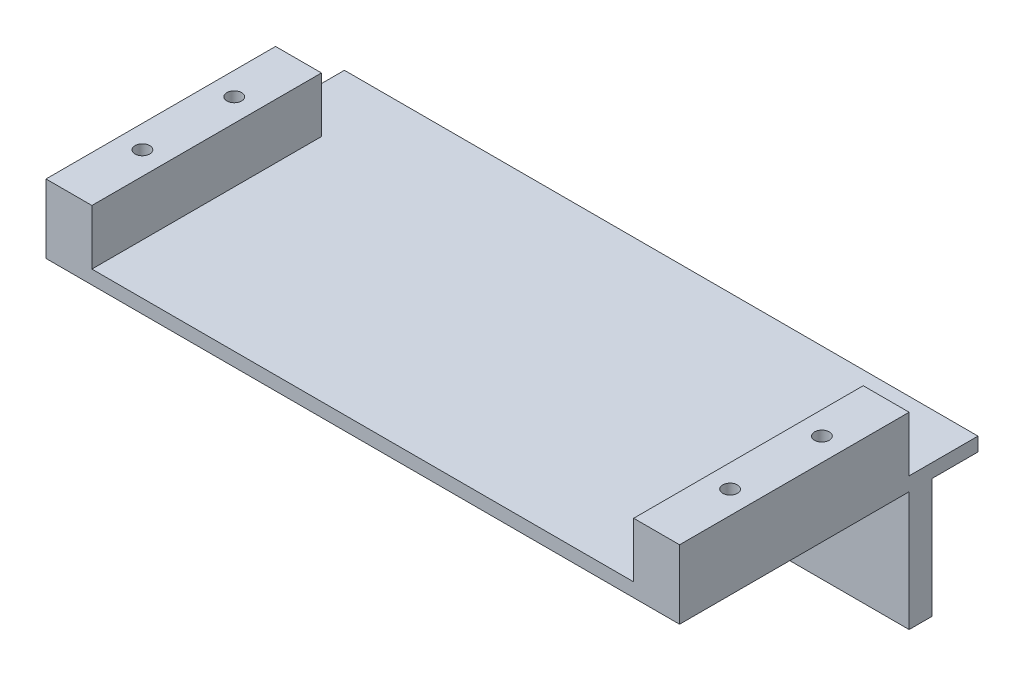
ISO-10303-21;
HEADER;
FILE_DESCRIPTION(('STEP AP214'),'2;1');
FILE_NAME('part.step','',(''),(''),'','','');
FILE_SCHEMA(('AUTOMOTIVE_DESIGN { 1 0 10303 214 1 1 1 1 }'));
ENDSEC;
DATA;
#1=APPLICATION_CONTEXT('core data for automotive mechanical design processes');
#2=APPLICATION_PROTOCOL_DEFINITION('international standard','automotive_design',2000,#1);
#3=PRODUCT_CONTEXT('',#1,'mechanical');
#4=PRODUCT('Part','Part','',(#3));
#5=PRODUCT_RELATED_PRODUCT_CATEGORY('part','',(#4));
#6=PRODUCT_DEFINITION_FORMATION('','',#4);
#7=PRODUCT_DEFINITION_CONTEXT('part definition',#1,'design');
#8=PRODUCT_DEFINITION('design','',#6,#7);
#9=PRODUCT_DEFINITION_SHAPE('','',#8);
#10=(LENGTH_UNIT() NAMED_UNIT(*) SI_UNIT(.MILLI.,.METRE.));
#11=(NAMED_UNIT(*) PLANE_ANGLE_UNIT() SI_UNIT($,.RADIAN.));
#12=(NAMED_UNIT(*) SI_UNIT($,.STERADIAN.) SOLID_ANGLE_UNIT());
#13=UNCERTAINTY_MEASURE_WITH_UNIT(LENGTH_MEASURE(1.E-05),#10,'distance_accuracy_value','');
#14=(GEOMETRIC_REPRESENTATION_CONTEXT(3) GLOBAL_UNCERTAINTY_ASSIGNED_CONTEXT((#13)) GLOBAL_UNIT_ASSIGNED_CONTEXT((#10,
#11,#12)) REPRESENTATION_CONTEXT('',''));
#15=CARTESIAN_POINT('',(0.,0.,0.));
#16=DIRECTION('',(0.,0.,1.));
#17=DIRECTION('',(1.,0.,0.));
#18=AXIS2_PLACEMENT_3D('',#15,#16,#17);
#19=CARTESIAN_POINT('',(0.,0.,5.));
#20=DIRECTION('',(0.,0.,1.));
#21=DIRECTION('',(1.,0.,0.));
#22=AXIS2_PLACEMENT_3D('',#19,#20,#21);
#23=PLANE('',#22);
#24=CARTESIAN_POINT('',(-29.7979797979798,-1.4299957918934,5.));
#25=DIRECTION('',(0.,0.,1.));
#26=DIRECTION('',(1.,0.,0.));
#27=AXIS2_PLACEMENT_3D('',#24,#25,#26);
#28=CIRCLE('',#27,2.1);
#29=CARTESIAN_POINT('',(-27.6979797979798,-1.4299957918934,5.));
#30=VERTEX_POINT('',#29);
#31=EDGE_CURVE('E289',#30,#30,#28,.T.);
#32=ORIENTED_EDGE('',*,*,#31,.F.);
#33=EDGE_LOOP('',(#32));
#34=FACE_BOUND('',#33,.T.);
#35=DIRECTION('',(0.,-1.,0.));
#36=VECTOR('',#35,1.);
#37=CARTESIAN_POINT('',(-49.7979797979798,14.5700042081066,5.));
#38=LINE('',#37,#36);
#39=CARTESIAN_POINT('',(-49.7979797979798,14.5700042081066,5.));
#40=VERTEX_POINT('',#39);
#41=CARTESIAN_POINT('',(-49.7979797979798,-11.4299957918934,5.));
#42=VERTEX_POINT('',#41);
#43=EDGE_CURVE('E297',#40,#42,#38,.T.);
#44=ORIENTED_EDGE('',*,*,#43,.T.);
#45=DIRECTION('',(1.,0.,0.));
#46=VECTOR('',#45,1.);
#47=CARTESIAN_POINT('',(-49.7979797979798,-11.4299957918934,5.));
#48=LINE('',#47,#46);
#49=CARTESIAN_POINT('',(88.2020202020202,-11.4299957918934,5.));
#50=VERTEX_POINT('',#49);
#51=EDGE_CURVE('E301',#42,#50,#48,.T.);
#52=ORIENTED_EDGE('',*,*,#51,.T.);
#53=DIRECTION('',(0.,1.,0.));
#54=VECTOR('',#53,1.);
#55=CARTESIAN_POINT('',(88.2020202020202,14.5700042081066,5.));
#56=LINE('',#55,#54);
#57=CARTESIAN_POINT('',(88.2020202020202,14.5700042081066,5.));
#58=VERTEX_POINT('',#57);
#59=EDGE_CURVE('E305',#50,#58,#56,.T.);
#60=ORIENTED_EDGE('',*,*,#59,.T.);
#61=DIRECTION('',(-1.,0.,0.));
#62=VECTOR('',#61,1.);
#63=CARTESIAN_POINT('',(-49.7979797979798,14.5700042081066,5.));
#64=LINE('',#63,#62);
#65=EDGE_CURVE('E309',#58,#40,#64,.T.);
#66=ORIENTED_EDGE('',*,*,#65,.T.);
#67=EDGE_LOOP('',(#44,#52,#60,#66));
#68=FACE_BOUND('',#67,.T.);
#69=CARTESIAN_POINT('',(68.2020202020202,-1.42999579189338,5.));
#70=DIRECTION('',(0.,0.,1.));
#71=DIRECTION('',(-1.,0.,0.));
#72=AXIS2_PLACEMENT_3D('',#69,#70,#71);
#73=CIRCLE('',#72,2.09999999999999);
#74=CARTESIAN_POINT('',(66.1020202020202,-1.42999579189338,5.));
#75=VERTEX_POINT('',#74);
#76=EDGE_CURVE('E281',#75,#75,#73,.T.);
#77=ORIENTED_EDGE('',*,*,#76,.F.);
#78=EDGE_LOOP('',(#77));
#79=FACE_BOUND('',#78,.T.);
#80=ADVANCED_FACE('F45',(#34,#68,#79),#23,.T.);
#81=CARTESIAN_POINT('',(0.,0.,0.));
#82=DIRECTION('',(0.,0.,1.));
#83=DIRECTION('',(1.,0.,0.));
#84=AXIS2_PLACEMENT_3D('',#81,#82,#83);
#85=PLANE('',#84);
#86=DIRECTION('',(0.,-1.,0.));
#87=VECTOR('',#86,1.);
#88=CARTESIAN_POINT('',(-49.7979797979798,14.5700042081066,0.));
#89=LINE('',#88,#87);
#90=CARTESIAN_POINT('',(-49.7979797979798,14.5700042081066,0.));
#91=VERTEX_POINT('',#90);
#92=CARTESIAN_POINT('',(-49.7979797979798,-11.4299957918934,0.));
#93=VERTEX_POINT('',#92);
#94=EDGE_CURVE('E293',#91,#93,#89,.T.);
#95=ORIENTED_EDGE('',*,*,#94,.F.);
#96=DIRECTION('',(-1.,0.,0.));
#97=VECTOR('',#96,1.);
#98=CARTESIAN_POINT('',(-49.7979797979798,14.5700042081066,0.));
#99=LINE('',#98,#97);
#100=CARTESIAN_POINT('',(88.2020202020202,14.5700042081066,0.));
#101=VERTEX_POINT('',#100);
#102=EDGE_CURVE('E302',#101,#91,#99,.T.);
#103=ORIENTED_EDGE('',*,*,#102,.F.);
#104=DIRECTION('',(0.,1.,0.));
#105=VECTOR('',#104,1.);
#106=CARTESIAN_POINT('',(88.2020202020202,14.5700042081066,0.));
#107=LINE('',#106,#105);
#108=CARTESIAN_POINT('',(88.2020202020202,-11.4299957918934,0.));
#109=VERTEX_POINT('',#108);
#110=EDGE_CURVE('E319',#109,#101,#107,.T.);
#111=ORIENTED_EDGE('',*,*,#110,.F.);
#112=DIRECTION('',(1.,0.,0.));
#113=VECTOR('',#112,1.);
#114=CARTESIAN_POINT('',(-49.7979797979798,-11.4299957918934,0.));
#115=LINE('',#114,#113);
#116=EDGE_CURVE('E316',#93,#109,#115,.T.);
#117=ORIENTED_EDGE('',*,*,#116,.F.);
#118=EDGE_LOOP('',(#95,#103,#111,#117));
#119=FACE_BOUND('',#118,.T.);
#120=CARTESIAN_POINT('',(-29.7979797979798,-1.4299957918934,0.));
#121=DIRECTION('',(0.,0.,1.));
#122=DIRECTION('',(1.,0.,0.));
#123=AXIS2_PLACEMENT_3D('',#120,#121,#122);
#124=CIRCLE('',#123,2.1);
#125=CARTESIAN_POINT('',(-27.6979797979798,-1.4299957918934,0.));
#126=VERTEX_POINT('',#125);
#127=EDGE_CURVE('E285',#126,#126,#124,.T.);
#128=ORIENTED_EDGE('',*,*,#127,.T.);
#129=EDGE_LOOP('',(#128));
#130=FACE_BOUND('',#129,.T.);
#131=CARTESIAN_POINT('',(68.2020202020202,-1.42999579189338,0.));
#132=DIRECTION('',(0.,0.,1.));
#133=DIRECTION('',(-1.,0.,0.));
#134=AXIS2_PLACEMENT_3D('',#131,#132,#133);
#135=CIRCLE('',#134,2.09999999999999);
#136=CARTESIAN_POINT('',(66.1020202020202,-1.42999579189338,0.));
#137=VERTEX_POINT('',#136);
#138=EDGE_CURVE('E280',#137,#137,#135,.T.);
#139=ORIENTED_EDGE('',*,*,#138,.T.);
#140=EDGE_LOOP('',(#139));
#141=FACE_BOUND('',#140,.T.);
#142=ADVANCED_FACE('F332',(#119,#130,#141),#85,.F.);
#143=CARTESIAN_POINT('',(-49.7979797979798,14.5700042081066,5.));
#144=DIRECTION('',(1.,0.,0.));
#145=DIRECTION('',(0.,0.,-1.));
#146=AXIS2_PLACEMENT_3D('',#143,#144,#145);
#147=PLANE('',#146);
#148=ORIENTED_EDGE('',*,*,#94,.T.);
#149=DIRECTION('',(0.,0.,-1.));
#150=VECTOR('',#149,1.);
#151=CARTESIAN_POINT('',(-49.7979797979798,-11.4299957918934,5.));
#152=LINE('',#151,#150);
#153=EDGE_CURVE('E11',#42,#93,#152,.T.);
#154=ORIENTED_EDGE('',*,*,#153,.F.);
#155=ORIENTED_EDGE('',*,*,#43,.F.);
#156=DIRECTION('',(0.,0.,1.));
#157=VECTOR('',#156,1.);
#158=CARTESIAN_POINT('',(-49.7979797979798,14.5700042081066,-10.));
#159=LINE('',#158,#157);
#160=CARTESIAN_POINT('',(-49.7979797979798,14.5700042081066,55.));
#161=VERTEX_POINT('',#160);
#162=EDGE_CURVE('E239',#40,#161,#159,.T.);
#163=ORIENTED_EDGE('',*,*,#162,.T.);
#164=DIRECTION('',(0.,-1.,0.));
#165=VECTOR('',#164,1.);
#166=CARTESIAN_POINT('',(-49.7979797979798,17.5700042081066,55.));
#167=LINE('',#166,#165);
#168=CARTESIAN_POINT('',(-49.7979797979798,29.5700042081066,55.));
#169=VERTEX_POINT('',#168);
#170=EDGE_CURVE('E276',#169,#161,#167,.T.);
#171=ORIENTED_EDGE('',*,*,#170,.F.);
#172=DIRECTION('',(0.,0.,1.));
#173=VECTOR('',#172,1.);
#174=CARTESIAN_POINT('',(-49.7979797979798,29.5700042081066,55.));
#175=LINE('',#174,#173);
#176=CARTESIAN_POINT('',(-49.7979797979798,29.5700042081066,5.00000000000001));
#177=VERTEX_POINT('',#176);
#178=EDGE_CURVE('E204',#177,#169,#175,.T.);
#179=ORIENTED_EDGE('',*,*,#178,.F.);
#180=DIRECTION('',(0.,-1.,0.));
#181=VECTOR('',#180,1.);
#182=CARTESIAN_POINT('',(-49.7979797979798,29.5700042081066,5.00000000000001));
#183=LINE('',#182,#181);
#184=CARTESIAN_POINT('',(-49.7979797979798,17.5700042081066,5.00000000000001));
#185=VERTEX_POINT('',#184);
#186=EDGE_CURVE('E194',#177,#185,#183,.T.);
#187=ORIENTED_EDGE('',*,*,#186,.T.);
#188=DIRECTION('',(0.,0.,1.));
#189=VECTOR('',#188,1.);
#190=CARTESIAN_POINT('',(-49.7979797979798,17.5700042081066,-10.));
#191=LINE('',#190,#189);
#192=CARTESIAN_POINT('',(-49.7979797979798,17.5700042081066,-10.));
#193=VERTEX_POINT('',#192);
#194=EDGE_CURVE('E240',#193,#185,#191,.T.);
#195=ORIENTED_EDGE('',*,*,#194,.F.);
#196=DIRECTION('',(0.,-1.,0.));
#197=VECTOR('',#196,1.);
#198=CARTESIAN_POINT('',(-49.7979797979798,17.5700042081066,-10.));
#199=LINE('',#198,#197);
#200=CARTESIAN_POINT('',(-49.7979797979798,14.5700042081066,-10.));
#201=VERTEX_POINT('',#200);
#202=EDGE_CURVE('E251',#193,#201,#199,.T.);
#203=ORIENTED_EDGE('',*,*,#202,.T.);
#204=EDGE_CURVE('E252',#201,#91,#159,.T.);
#205=ORIENTED_EDGE('',*,*,#204,.T.);
#206=EDGE_LOOP('',(#148,#154,#155,#163,#171,#179,#187,#195,#203,#205));
#207=FACE_BOUND('',#206,.T.);
#208=ADVANCED_FACE('F47',(#207),#147,.F.);
#209=CARTESIAN_POINT('',(-49.7979797979798,-11.4299957918934,5.));
#210=DIRECTION('',(0.,1.,0.));
#211=DIRECTION('',(-1.,0.,0.));
#212=AXIS2_PLACEMENT_3D('',#209,#210,#211);
#213=PLANE('',#212);
#214=ORIENTED_EDGE('',*,*,#116,.T.);
#215=DIRECTION('',(0.,0.,-1.));
#216=VECTOR('',#215,1.);
#217=CARTESIAN_POINT('',(88.2020202020202,-11.4299957918934,5.));
#218=LINE('',#217,#216);
#219=EDGE_CURVE('E54',#50,#109,#218,.T.);
#220=ORIENTED_EDGE('',*,*,#219,.F.);
#221=ORIENTED_EDGE('',*,*,#51,.F.);
#222=ORIENTED_EDGE('',*,*,#153,.T.);
#223=EDGE_LOOP('',(#214,#220,#221,#222));
#224=FACE_BOUND('',#223,.T.);
#225=ADVANCED_FACE('F394',(#224),#213,.F.);
#226=CARTESIAN_POINT('',(88.2020202020202,14.5700042081066,5.));
#227=DIRECTION('',(-1.,0.,0.));
#228=DIRECTION('',(0.,0.,1.));
#229=AXIS2_PLACEMENT_3D('',#226,#227,#228);
#230=PLANE('',#229);
#231=ORIENTED_EDGE('',*,*,#110,.T.);
#232=DIRECTION('',(0.,0.,-1.));
#233=VECTOR('',#232,1.);
#234=CARTESIAN_POINT('',(88.2020202020202,14.5700042081066,-10.));
#235=LINE('',#234,#233);
#236=CARTESIAN_POINT('',(88.2020202020202,14.5700042081066,-10.));
#237=VERTEX_POINT('',#236);
#238=EDGE_CURVE('E259',#101,#237,#235,.T.);
#239=ORIENTED_EDGE('',*,*,#238,.T.);
#240=DIRECTION('',(0.,-1.,0.));
#241=VECTOR('',#240,1.);
#242=CARTESIAN_POINT('',(88.2020202020202,17.5700042081066,-10.));
#243=LINE('',#242,#241);
#244=CARTESIAN_POINT('',(88.2020202020202,17.5700042081066,-10.));
#245=VERTEX_POINT('',#244);
#246=EDGE_CURVE('E269',#245,#237,#243,.T.);
#247=ORIENTED_EDGE('',*,*,#246,.F.);
#248=DIRECTION('',(0.,0.,-1.));
#249=VECTOR('',#248,1.);
#250=CARTESIAN_POINT('',(88.2020202020202,17.5700042081066,-10.));
#251=LINE('',#250,#249);
#252=CARTESIAN_POINT('',(88.2020202020202,17.5700042081066,5.));
#253=VERTEX_POINT('',#252);
#254=EDGE_CURVE('E173',#253,#245,#251,.T.);
#255=ORIENTED_EDGE('',*,*,#254,.F.);
#256=DIRECTION('',(0.,-1.,0.));
#257=VECTOR('',#256,1.);
#258=CARTESIAN_POINT('',(88.2020202020202,29.5700042081066,5.));
#259=LINE('',#258,#257);
#260=CARTESIAN_POINT('',(88.2020202020202,29.5700042081066,5.));
#261=VERTEX_POINT('',#260);
#262=EDGE_CURVE('E150',#261,#253,#259,.T.);
#263=ORIENTED_EDGE('',*,*,#262,.F.);
#264=DIRECTION('',(0.,0.,-1.));
#265=VECTOR('',#264,1.);
#266=CARTESIAN_POINT('',(88.2020202020202,29.5700042081066,55.));
#267=LINE('',#266,#265);
#268=CARTESIAN_POINT('',(88.2020202020202,29.5700042081066,55.));
#269=VERTEX_POINT('',#268);
#270=EDGE_CURVE('E157',#269,#261,#267,.T.);
#271=ORIENTED_EDGE('',*,*,#270,.F.);
#272=DIRECTION('',(0.,-1.,0.));
#273=VECTOR('',#272,1.);
#274=CARTESIAN_POINT('',(88.2020202020202,17.5700042081066,55.));
#275=LINE('',#274,#273);
#276=CARTESIAN_POINT('',(88.2020202020202,14.5700042081066,55.));
#277=VERTEX_POINT('',#276);
#278=EDGE_CURVE('E273',#269,#277,#275,.T.);
#279=ORIENTED_EDGE('',*,*,#278,.T.);
#280=EDGE_CURVE('E260',#277,#58,#235,.T.);
#281=ORIENTED_EDGE('',*,*,#280,.T.);
#282=ORIENTED_EDGE('',*,*,#59,.F.);
#283=ORIENTED_EDGE('',*,*,#219,.T.);
#284=EDGE_LOOP('',(#231,#239,#247,#255,#263,#271,#279,#281,#282,#283));
#285=FACE_BOUND('',#284,.T.);
#286=ADVANCED_FACE('F171',(#285),#230,.F.);
#287=CARTESIAN_POINT('',(-29.7979797979798,-1.4299957918934,5.));
#288=DIRECTION('',(0.,0.,-1.));
#289=DIRECTION('',(-1.,0.,0.));
#290=AXIS2_PLACEMENT_3D('',#287,#288,#289);
#291=CYLINDRICAL_SURFACE('',#290,2.1);
#292=ORIENTED_EDGE('',*,*,#31,.T.);
#293=EDGE_LOOP('',(#292));
#294=FACE_BOUND('',#293,.T.);
#295=ORIENTED_EDGE('',*,*,#127,.F.);
#296=EDGE_LOOP('',(#295));
#297=FACE_BOUND('',#296,.T.);
#298=ADVANCED_FACE('F390',(#294,#297),#291,.F.);
#299=CARTESIAN_POINT('',(68.2020202020202,-1.42999579189338,5.));
#300=DIRECTION('',(0.,0.,-1.));
#301=DIRECTION('',(-1.,0.,0.));
#302=AXIS2_PLACEMENT_3D('',#299,#300,#301);
#303=CYLINDRICAL_SURFACE('',#302,2.09999999999999);
#304=ORIENTED_EDGE('',*,*,#76,.T.);
#305=EDGE_LOOP('',(#304));
#306=FACE_BOUND('',#305,.T.);
#307=ORIENTED_EDGE('',*,*,#138,.F.);
#308=EDGE_LOOP('',(#307));
#309=FACE_BOUND('',#308,.T.);
#310=ADVANCED_FACE('F462',(#306,#309),#303,.F.);
#311=CARTESIAN_POINT('',(0.,14.5700042081066,0.));
#312=DIRECTION('',(0.,1.,0.));
#313=DIRECTION('',(-1.,0.,0.));
#314=AXIS2_PLACEMENT_3D('',#311,#312,#313);
#315=PLANE('',#314);
#316=ORIENTED_EDGE('',*,*,#238,.F.);
#317=ORIENTED_EDGE('',*,*,#102,.T.);
#318=ORIENTED_EDGE('',*,*,#204,.F.);
#319=DIRECTION('',(-1.,0.,0.));
#320=VECTOR('',#319,1.);
#321=CARTESIAN_POINT('',(-49.7979797979798,14.5700042081066,-10.));
#322=LINE('',#321,#320);
#323=EDGE_CURVE('E243',#237,#201,#322,.T.);
#324=ORIENTED_EDGE('',*,*,#323,.F.);
#325=EDGE_LOOP('',(#316,#317,#318,#324));
#326=FACE_BOUND('',#325,.T.);
#327=ADVANCED_FACE('F336',(#326),#315,.F.);
#328=CARTESIAN_POINT('',(-49.7979797979798,17.5700042081066,55.));
#329=DIRECTION('',(0.,0.,-1.));
#330=DIRECTION('',(-1.,0.,0.));
#331=AXIS2_PLACEMENT_3D('',#328,#329,#330);
#332=PLANE('',#331);
#333=DIRECTION('',(1.,0.,0.));
#334=VECTOR('',#333,1.);
#335=CARTESIAN_POINT('',(-49.7979797979798,14.5700042081066,55.));
#336=LINE('',#335,#334);
#337=EDGE_CURVE('E256',#161,#277,#336,.T.);
#338=ORIENTED_EDGE('',*,*,#337,.T.);
#339=ORIENTED_EDGE('',*,*,#278,.F.);
#340=DIRECTION('',(1.,0.,0.));
#341=VECTOR('',#340,1.);
#342=CARTESIAN_POINT('',(88.2020202020202,29.5700042081066,55.));
#343=LINE('',#342,#341);
#344=CARTESIAN_POINT('',(78.2020202020202,29.5700042081066,55.));
#345=VERTEX_POINT('',#344);
#346=EDGE_CURVE('E164',#345,#269,#343,.T.);
#347=ORIENTED_EDGE('',*,*,#346,.F.);
#348=DIRECTION('',(0.,-1.,0.));
#349=VECTOR('',#348,1.);
#350=CARTESIAN_POINT('',(78.2020202020202,29.5700042081066,55.));
#351=LINE('',#350,#349);
#352=CARTESIAN_POINT('',(78.2020202020203,17.5700042081066,55.));
#353=VERTEX_POINT('',#352);
#354=EDGE_CURVE('E182',#345,#353,#351,.T.);
#355=ORIENTED_EDGE('',*,*,#354,.T.);
#356=DIRECTION('',(1.,0.,0.));
#357=VECTOR('',#356,1.);
#358=CARTESIAN_POINT('',(-49.7979797979798,17.5700042081066,55.));
#359=LINE('',#358,#357);
#360=CARTESIAN_POINT('',(-39.7979797979798,17.5700042081066,55.));
#361=VERTEX_POINT('',#360);
#362=EDGE_CURVE('E67',#361,#353,#359,.T.);
#363=ORIENTED_EDGE('',*,*,#362,.F.);
#364=DIRECTION('',(0.,-1.,0.));
#365=VECTOR('',#364,1.);
#366=CARTESIAN_POINT('',(-39.7979797979798,29.5700042081066,55.));
#367=LINE('',#366,#365);
#368=CARTESIAN_POINT('',(-39.7979797979798,29.5700042081066,55.));
#369=VERTEX_POINT('',#368);
#370=EDGE_CURVE('E186',#369,#361,#367,.T.);
#371=ORIENTED_EDGE('',*,*,#370,.F.);
#372=DIRECTION('',(1.,0.,0.));
#373=VECTOR('',#372,1.);
#374=CARTESIAN_POINT('',(-49.7979797979798,29.5700042081066,55.));
#375=LINE('',#374,#373);
#376=EDGE_CURVE('E214',#169,#369,#375,.T.);
#377=ORIENTED_EDGE('',*,*,#376,.F.);
#378=ORIENTED_EDGE('',*,*,#170,.T.);
#379=EDGE_LOOP('',(#338,#339,#347,#355,#363,#371,#377,#378));
#380=FACE_BOUND('',#379,.T.);
#381=ADVANCED_FACE('F355',(#380),#332,.F.);
#382=CARTESIAN_POINT('',(-49.7979797979798,17.5700042081066,-10.));
#383=DIRECTION('',(0.,0.,1.));
#384=DIRECTION('',(1.,0.,0.));
#385=AXIS2_PLACEMENT_3D('',#382,#383,#384);
#386=PLANE('',#385);
#387=ORIENTED_EDGE('',*,*,#323,.T.);
#388=ORIENTED_EDGE('',*,*,#202,.F.);
#389=DIRECTION('',(-1.,0.,0.));
#390=VECTOR('',#389,1.);
#391=CARTESIAN_POINT('',(-49.7979797979798,17.5700042081066,-10.));
#392=LINE('',#391,#390);
#393=EDGE_CURVE('E248',#245,#193,#392,.T.);
#394=ORIENTED_EDGE('',*,*,#393,.F.);
#395=ORIENTED_EDGE('',*,*,#246,.T.);
#396=EDGE_LOOP('',(#387,#388,#394,#395));
#397=FACE_BOUND('',#396,.T.);
#398=ADVANCED_FACE('F344',(#397),#386,.F.);
#399=CARTESIAN_POINT('',(0.,17.5700042081066,0.));
#400=DIRECTION('',(0.,1.,0.));
#401=DIRECTION('',(-1.,0.,0.));
#402=AXIS2_PLACEMENT_3D('',#399,#400,#401);
#403=PLANE('',#402);
#404=DIRECTION('',(0.,0.,1.));
#405=VECTOR('',#404,1.);
#406=CARTESIAN_POINT('',(78.2020202020202,17.5700042081066,55.));
#407=LINE('',#406,#405);
#408=CARTESIAN_POINT('',(78.2020202020203,17.5700042081066,5.));
#409=VERTEX_POINT('',#408);
#410=EDGE_CURVE('E168',#409,#353,#407,.T.);
#411=ORIENTED_EDGE('',*,*,#410,.F.);
#412=DIRECTION('',(-1.,0.,0.));
#413=VECTOR('',#412,1.);
#414=CARTESIAN_POINT('',(88.2020202020202,17.5700042081066,5.));
#415=LINE('',#414,#413);
#416=EDGE_CURVE('E61',#253,#409,#415,.T.);
#417=ORIENTED_EDGE('',*,*,#416,.F.);
#418=ORIENTED_EDGE('',*,*,#254,.T.);
#419=ORIENTED_EDGE('',*,*,#393,.T.);
#420=ORIENTED_EDGE('',*,*,#194,.T.);
#421=DIRECTION('',(-1.,0.,0.));
#422=VECTOR('',#421,1.);
#423=CARTESIAN_POINT('',(-49.7979797979798,17.5700042081066,5.00000000000001));
#424=LINE('',#423,#422);
#425=CARTESIAN_POINT('',(-39.7979797979798,17.5700042081066,5.00000000000001));
#426=VERTEX_POINT('',#425);
#427=EDGE_CURVE('E199',#426,#185,#424,.T.);
#428=ORIENTED_EDGE('',*,*,#427,.F.);
#429=DIRECTION('',(0.,0.,-1.));
#430=VECTOR('',#429,1.);
#431=CARTESIAN_POINT('',(-39.7979797979798,17.5700042081066,55.));
#432=LINE('',#431,#430);
#433=EDGE_CURVE('E203',#361,#426,#432,.T.);
#434=ORIENTED_EDGE('',*,*,#433,.F.);
#435=ORIENTED_EDGE('',*,*,#362,.T.);
#436=EDGE_LOOP('',(#411,#417,#418,#419,#420,#428,#434,#435));
#437=FACE_BOUND('',#436,.T.);
#438=ADVANCED_FACE('F366',(#437),#403,.T.);
#439=CARTESIAN_POINT('',(-44.7979797979798,14.5700042081066,39.));
#440=DIRECTION('',(0.,1.,0.));
#441=DIRECTION('',(-1.,0.,0.));
#442=AXIS2_PLACEMENT_3D('',#439,#440,#441);
#443=CIRCLE('',#442,1.6);
#444=CARTESIAN_POINT('',(-46.3979797979798,14.5700042081066,39.));
#445=VERTEX_POINT('',#444);
#446=EDGE_CURVE('E228',#445,#445,#443,.T.);
#447=ORIENTED_EDGE('',*,*,#446,.T.);
#448=EDGE_LOOP('',(#447));
#449=FACE_BOUND('',#448,.T.);
#450=CARTESIAN_POINT('',(83.2020202020202,14.5700042081066,19.));
#451=DIRECTION('',(0.,1.,0.));
#452=DIRECTION('',(-1.,0.,0.));
#453=AXIS2_PLACEMENT_3D('',#450,#451,#452);
#454=CIRCLE('',#453,1.6);
#455=CARTESIAN_POINT('',(81.6020202020202,14.5700042081066,19.));
#456=VERTEX_POINT('',#455);
#457=EDGE_CURVE('E180',#456,#456,#454,.T.);
#458=ORIENTED_EDGE('',*,*,#457,.T.);
#459=EDGE_LOOP('',(#458));
#460=FACE_BOUND('',#459,.T.);
#461=CARTESIAN_POINT('',(83.2020202020202,14.5700042081066,39.));
#462=DIRECTION('',(0.,1.,0.));
#463=DIRECTION('',(-1.,0.,0.));
#464=AXIS2_PLACEMENT_3D('',#461,#462,#463);
#465=CIRCLE('',#464,1.60000000000001);
#466=CARTESIAN_POINT('',(81.6020202020202,14.5700042081066,39.));
#467=VERTEX_POINT('',#466);
#468=EDGE_CURVE('E175',#467,#467,#465,.T.);
#469=ORIENTED_EDGE('',*,*,#468,.T.);
#470=EDGE_LOOP('',(#469));
#471=FACE_BOUND('',#470,.T.);
#472=CARTESIAN_POINT('',(-44.7979797979798,14.5700042081066,19.));
#473=DIRECTION('',(0.,1.,0.));
#474=DIRECTION('',(-1.,0.,0.));
#475=AXIS2_PLACEMENT_3D('',#472,#473,#474);
#476=CIRCLE('',#475,1.6);
#477=CARTESIAN_POINT('',(-46.3979797979798,14.5700042081066,19.));
#478=VERTEX_POINT('',#477);
#479=EDGE_CURVE('E232',#478,#478,#476,.T.);
#480=ORIENTED_EDGE('',*,*,#479,.T.);
#481=EDGE_LOOP('',(#480));
#482=FACE_BOUND('',#481,.T.);
#483=ORIENTED_EDGE('',*,*,#65,.F.);
#484=ORIENTED_EDGE('',*,*,#280,.F.);
#485=ORIENTED_EDGE('',*,*,#337,.F.);
#486=ORIENTED_EDGE('',*,*,#162,.F.);
#487=EDGE_LOOP('',(#483,#484,#485,#486));
#488=FACE_BOUND('',#487,.T.);
#489=ADVANCED_FACE('F353',(#449,#460,#471,#482,#488),#315,.F.);
#490=CARTESIAN_POINT('',(-44.7979797979798,14.5700042081066,19.));
#491=DIRECTION('',(0.,1.,0.));
#492=DIRECTION('',(-1.,0.,0.));
#493=AXIS2_PLACEMENT_3D('',#490,#491,#492);
#494=CYLINDRICAL_SURFACE('',#493,1.6);
#495=ORIENTED_EDGE('',*,*,#479,.F.);
#496=EDGE_LOOP('',(#495));
#497=FACE_BOUND('',#496,.T.);
#498=CARTESIAN_POINT('',(-44.7979797979798,29.5700042081066,19.));
#499=DIRECTION('',(0.,1.,0.));
#500=DIRECTION('',(1.,0.,0.));
#501=AXIS2_PLACEMENT_3D('',#498,#499,#500);
#502=CIRCLE('',#501,1.6);
#503=CARTESIAN_POINT('',(-43.1979797979798,29.5700042081066,19.));
#504=VERTEX_POINT('',#503);
#505=EDGE_CURVE('E223',#504,#504,#502,.T.);
#506=ORIENTED_EDGE('',*,*,#505,.T.);
#507=EDGE_LOOP('',(#506));
#508=FACE_BOUND('',#507,.T.);
#509=ADVANCED_FACE('F438',(#497,#508),#494,.F.);
#510=CARTESIAN_POINT('',(83.2020202020202,14.5700042081066,39.));
#511=DIRECTION('',(0.,1.,0.));
#512=DIRECTION('',(-1.,0.,0.));
#513=AXIS2_PLACEMENT_3D('',#510,#511,#512);
#514=CYLINDRICAL_SURFACE('',#513,1.60000000000001);
#515=ORIENTED_EDGE('',*,*,#468,.F.);
#516=EDGE_LOOP('',(#515));
#517=FACE_BOUND('',#516,.T.);
#518=CARTESIAN_POINT('',(83.2020202020202,29.5700042081066,39.));
#519=DIRECTION('',(0.,1.,0.));
#520=DIRECTION('',(-1.,0.,0.));
#521=AXIS2_PLACEMENT_3D('',#518,#519,#520);
#522=CIRCLE('',#521,1.60000000000001);
#523=CARTESIAN_POINT('',(81.6020202020202,29.5700042081066,39.));
#524=VERTEX_POINT('',#523);
#525=EDGE_CURVE('E226',#524,#524,#522,.T.);
#526=ORIENTED_EDGE('',*,*,#525,.T.);
#527=EDGE_LOOP('',(#526));
#528=FACE_BOUND('',#527,.T.);
#529=ADVANCED_FACE('F435',(#517,#528),#514,.F.);
#530=CARTESIAN_POINT('',(83.2020202020202,14.5700042081066,19.));
#531=DIRECTION('',(0.,1.,0.));
#532=DIRECTION('',(-1.,0.,0.));
#533=AXIS2_PLACEMENT_3D('',#530,#531,#532);
#534=CYLINDRICAL_SURFACE('',#533,1.6);
#535=ORIENTED_EDGE('',*,*,#457,.F.);
#536=EDGE_LOOP('',(#535));
#537=FACE_BOUND('',#536,.T.);
#538=CARTESIAN_POINT('',(83.2020202020202,29.5700042081066,19.));
#539=DIRECTION('',(0.,1.,0.));
#540=DIRECTION('',(-1.,0.,0.));
#541=AXIS2_PLACEMENT_3D('',#538,#539,#540);
#542=CIRCLE('',#541,1.6);
#543=CARTESIAN_POINT('',(81.6020202020202,29.5700042081066,19.));
#544=VERTEX_POINT('',#543);
#545=EDGE_CURVE('E411',#544,#544,#542,.T.);
#546=ORIENTED_EDGE('',*,*,#545,.T.);
#547=EDGE_LOOP('',(#546));
#548=FACE_BOUND('',#547,.T.);
#549=ADVANCED_FACE('F437',(#537,#548),#534,.F.);
#550=CARTESIAN_POINT('',(-44.7979797979798,14.5700042081066,39.));
#551=DIRECTION('',(0.,1.,0.));
#552=DIRECTION('',(-1.,0.,0.));
#553=AXIS2_PLACEMENT_3D('',#550,#551,#552);
#554=CYLINDRICAL_SURFACE('',#553,1.6);
#555=ORIENTED_EDGE('',*,*,#446,.F.);
#556=EDGE_LOOP('',(#555));
#557=FACE_BOUND('',#556,.T.);
#558=CARTESIAN_POINT('',(-44.7979797979798,29.5700042081066,39.));
#559=DIRECTION('',(0.,1.,0.));
#560=DIRECTION('',(1.,0.,0.));
#561=AXIS2_PLACEMENT_3D('',#558,#559,#560);
#562=CIRCLE('',#561,1.60000000000001);
#563=CARTESIAN_POINT('',(-43.1979797979798,29.5700042081066,39.));
#564=VERTEX_POINT('',#563);
#565=EDGE_CURVE('E208',#564,#564,#562,.T.);
#566=ORIENTED_EDGE('',*,*,#565,.T.);
#567=EDGE_LOOP('',(#566));
#568=FACE_BOUND('',#567,.T.);
#569=ADVANCED_FACE('F376',(#557,#568),#554,.F.);
#570=CARTESIAN_POINT('',(0.,29.5700042081066,0.));
#571=DIRECTION('',(0.,-1.,0.));
#572=DIRECTION('',(1.,0.,0.));
#573=AXIS2_PLACEMENT_3D('',#570,#571,#572);
#574=PLANE('',#573);
#575=ORIENTED_EDGE('',*,*,#178,.T.);
#576=ORIENTED_EDGE('',*,*,#376,.T.);
#577=DIRECTION('',(0.,0.,-1.));
#578=VECTOR('',#577,1.);
#579=CARTESIAN_POINT('',(-39.7979797979798,29.5700042081066,55.));
#580=LINE('',#579,#578);
#581=CARTESIAN_POINT('',(-39.7979797979798,29.5700042081066,5.00000000000001));
#582=VERTEX_POINT('',#581);
#583=EDGE_CURVE('E211',#369,#582,#580,.T.);
#584=ORIENTED_EDGE('',*,*,#583,.T.);
#585=DIRECTION('',(-1.,0.,0.));
#586=VECTOR('',#585,1.);
#587=CARTESIAN_POINT('',(-49.7979797979798,29.5700042081066,5.00000000000001));
#588=LINE('',#587,#586);
#589=EDGE_CURVE('E198',#582,#177,#588,.T.);
#590=ORIENTED_EDGE('',*,*,#589,.T.);
#591=EDGE_LOOP('',(#575,#576,#584,#590));
#592=FACE_BOUND('',#591,.T.);
#593=ORIENTED_EDGE('',*,*,#565,.F.);
#594=EDGE_LOOP('',(#593));
#595=FACE_BOUND('',#594,.T.);
#596=ORIENTED_EDGE('',*,*,#505,.F.);
#597=EDGE_LOOP('',(#596));
#598=FACE_BOUND('',#597,.T.);
#599=ADVANCED_FACE('F359',(#592,#595,#598),#574,.F.);
#600=CARTESIAN_POINT('',(-39.7979797979798,29.5700042081066,55.));
#601=DIRECTION('',(-1.,0.,0.));
#602=DIRECTION('',(0.,0.,1.));
#603=AXIS2_PLACEMENT_3D('',#600,#601,#602);
#604=PLANE('',#603);
#605=ORIENTED_EDGE('',*,*,#433,.T.);
#606=DIRECTION('',(0.,-1.,0.));
#607=VECTOR('',#606,1.);
#608=CARTESIAN_POINT('',(-39.7979797979798,29.5700042081066,5.00000000000001));
#609=LINE('',#608,#607);
#610=EDGE_CURVE('E190',#582,#426,#609,.T.);
#611=ORIENTED_EDGE('',*,*,#610,.F.);
#612=ORIENTED_EDGE('',*,*,#583,.F.);
#613=ORIENTED_EDGE('',*,*,#370,.T.);
#614=EDGE_LOOP('',(#605,#611,#612,#613));
#615=FACE_BOUND('',#614,.T.);
#616=ADVANCED_FACE('F368',(#615),#604,.F.);
#617=CARTESIAN_POINT('',(-49.7979797979798,29.5700042081066,5.00000000000001));
#618=DIRECTION('',(0.,0.,1.));
#619=DIRECTION('',(1.,0.,0.));
#620=AXIS2_PLACEMENT_3D('',#617,#618,#619);
#621=PLANE('',#620);
#622=ORIENTED_EDGE('',*,*,#427,.T.);
#623=ORIENTED_EDGE('',*,*,#186,.F.);
#624=ORIENTED_EDGE('',*,*,#589,.F.);
#625=ORIENTED_EDGE('',*,*,#610,.T.);
#626=EDGE_LOOP('',(#622,#623,#624,#625));
#627=FACE_BOUND('',#626,.T.);
#628=ADVANCED_FACE('F364',(#627),#621,.F.);
#629=CARTESIAN_POINT('',(0.,29.5700042081066,0.));
#630=DIRECTION('',(0.,1.,0.));
#631=DIRECTION('',(0.,0.,1.));
#632=AXIS2_PLACEMENT_3D('',#629,#630,#631);
#633=PLANE('',#632);
#634=ORIENTED_EDGE('',*,*,#545,.F.);
#635=EDGE_LOOP('',(#634));
#636=FACE_BOUND('',#635,.T.);
#637=ORIENTED_EDGE('',*,*,#270,.T.);
#638=DIRECTION('',(-1.,0.,0.));
#639=VECTOR('',#638,1.);
#640=CARTESIAN_POINT('',(88.2020202020202,29.5700042081066,5.));
#641=LINE('',#640,#639);
#642=CARTESIAN_POINT('',(78.2020202020203,29.5700042081066,5.));
#643=VERTEX_POINT('',#642);
#644=EDGE_CURVE('E146',#261,#643,#641,.T.);
#645=ORIENTED_EDGE('',*,*,#644,.T.);
#646=DIRECTION('',(0.,0.,1.));
#647=VECTOR('',#646,1.);
#648=CARTESIAN_POINT('',(78.2020202020202,29.5700042081066,55.));
#649=LINE('',#648,#647);
#650=EDGE_CURVE('E156',#643,#345,#649,.T.);
#651=ORIENTED_EDGE('',*,*,#650,.T.);
#652=ORIENTED_EDGE('',*,*,#346,.T.);
#653=EDGE_LOOP('',(#637,#645,#651,#652));
#654=FACE_BOUND('',#653,.T.);
#655=ORIENTED_EDGE('',*,*,#525,.F.);
#656=EDGE_LOOP('',(#655));
#657=FACE_BOUND('',#656,.T.);
#658=ADVANCED_FACE('F161',(#636,#654,#657),#633,.T.);
#659=CARTESIAN_POINT('',(88.2020202020202,29.5700042081066,5.));
#660=DIRECTION('',(0.,0.,1.));
#661=DIRECTION('',(1.,0.,0.));
#662=AXIS2_PLACEMENT_3D('',#659,#660,#661);
#663=PLANE('',#662);
#664=ORIENTED_EDGE('',*,*,#416,.T.);
#665=DIRECTION('',(0.,-1.,0.));
#666=VECTOR('',#665,1.);
#667=CARTESIAN_POINT('',(78.2020202020203,29.5700042081066,5.));
#668=LINE('',#667,#666);
#669=EDGE_CURVE('E152',#643,#409,#668,.T.);
#670=ORIENTED_EDGE('',*,*,#669,.F.);
#671=ORIENTED_EDGE('',*,*,#644,.F.);
#672=ORIENTED_EDGE('',*,*,#262,.T.);
#673=EDGE_LOOP('',(#664,#670,#671,#672));
#674=FACE_BOUND('',#673,.T.);
#675=ADVANCED_FACE('F148',(#674),#663,.F.);
#676=CARTESIAN_POINT('',(78.2020202020202,29.5700042081066,55.));
#677=DIRECTION('',(1.,0.,0.));
#678=DIRECTION('',(0.,0.,-1.));
#679=AXIS2_PLACEMENT_3D('',#676,#677,#678);
#680=PLANE('',#679);
#681=ORIENTED_EDGE('',*,*,#410,.T.);
#682=ORIENTED_EDGE('',*,*,#354,.F.);
#683=ORIENTED_EDGE('',*,*,#650,.F.);
#684=ORIENTED_EDGE('',*,*,#669,.T.);
#685=EDGE_LOOP('',(#681,#682,#683,#684));
#686=FACE_BOUND('',#685,.T.);
#687=ADVANCED_FACE('F414',(#686),#680,.F.);
#688=CLOSED_SHELL('',(#80,#142,#208,#225,#286,#298,#310,#327,#381,#398,#438,#489,#509,#529,#549,
#569,#599,#616,#628,#658,#675,#687));
#689=MANIFOLD_SOLID_BREP('B2',#688);
#690=ADVANCED_BREP_SHAPE_REPRESENTATION('',(#18,#689),#14);
#691=SHAPE_DEFINITION_REPRESENTATION(#9,#690);
ENDSEC;
END-ISO-10303-21;
